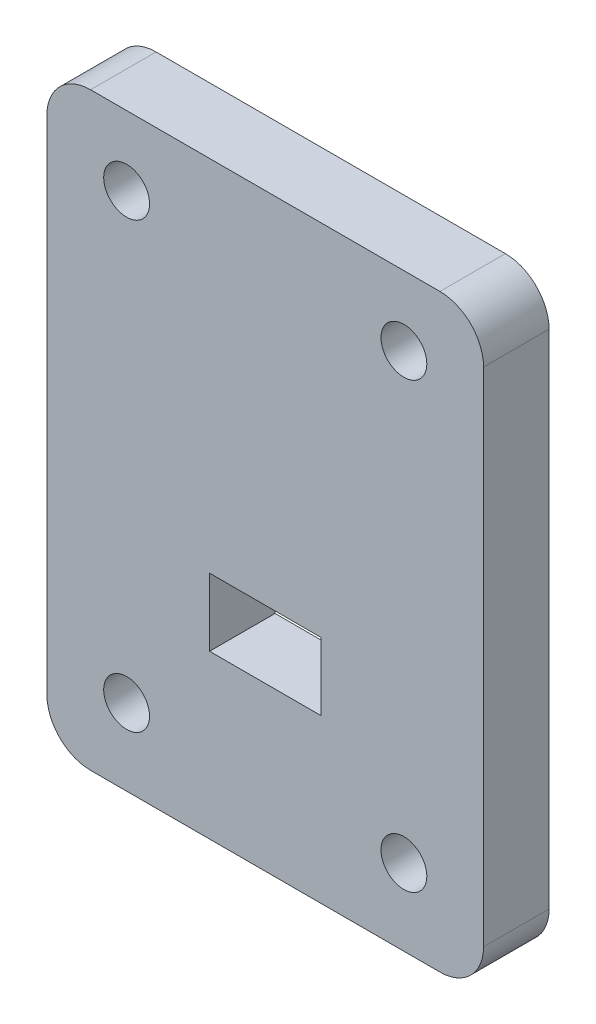
ISO-10303-21;
HEADER;
FILE_DESCRIPTION(('STEP AP214'),'2;1');
FILE_NAME('part.step','',(''),(''),'','','');
FILE_SCHEMA(('AUTOMOTIVE_DESIGN { 1 0 10303 214 1 1 1 1 }'));
ENDSEC;
DATA;
#1=APPLICATION_CONTEXT('core data for automotive mechanical design processes');
#2=APPLICATION_PROTOCOL_DEFINITION('international standard','automotive_design',2000,#1);
#3=PRODUCT_CONTEXT('',#1,'mechanical');
#4=PRODUCT('Part','Part','',(#3));
#5=PRODUCT_RELATED_PRODUCT_CATEGORY('part','',(#4));
#6=PRODUCT_DEFINITION_FORMATION('','',#4);
#7=PRODUCT_DEFINITION_CONTEXT('part definition',#1,'design');
#8=PRODUCT_DEFINITION('design','',#6,#7);
#9=PRODUCT_DEFINITION_SHAPE('','',#8);
#10=(LENGTH_UNIT() NAMED_UNIT(*) SI_UNIT(.MILLI.,.METRE.));
#11=(NAMED_UNIT(*) PLANE_ANGLE_UNIT() SI_UNIT($,.RADIAN.));
#12=(NAMED_UNIT(*) SI_UNIT($,.STERADIAN.) SOLID_ANGLE_UNIT());
#13=UNCERTAINTY_MEASURE_WITH_UNIT(LENGTH_MEASURE(1.E-05),#10,'distance_accuracy_value','');
#14=(GEOMETRIC_REPRESENTATION_CONTEXT(3) GLOBAL_UNCERTAINTY_ASSIGNED_CONTEXT((#13)) GLOBAL_UNIT_ASSIGNED_CONTEXT((#10,
#11,#12)) REPRESENTATION_CONTEXT('',''));
#15=CARTESIAN_POINT('',(0.,0.,0.));
#16=DIRECTION('',(0.,0.,1.));
#17=DIRECTION('',(1.,0.,0.));
#18=AXIS2_PLACEMENT_3D('',#15,#16,#17);
#19=CARTESIAN_POINT('',(10.,-13.5,3.));
#20=DIRECTION('',(-1.,0.,0.));
#21=DIRECTION('',(0.,0.,1.));
#22=AXIS2_PLACEMENT_3D('',#19,#20,#21);
#23=PLANE('',#22);
#24=DIRECTION('',(0.,1.,0.));
#25=VECTOR('',#24,1.);
#26=CARTESIAN_POINT('',(10.,-13.5,0.));
#27=LINE('',#26,#25);
#28=CARTESIAN_POINT('',(10.,-11.5,0.));
#29=VERTEX_POINT('',#28);
#30=CARTESIAN_POINT('',(10.,11.5,0.));
#31=VERTEX_POINT('',#30);
#32=EDGE_CURVE('E158',#29,#31,#27,.T.);
#33=ORIENTED_EDGE('',*,*,#32,.T.);
#34=DIRECTION('',(0.,0.,-1.));
#35=VECTOR('',#34,1.);
#36=CARTESIAN_POINT('',(10.,11.5,3.));
#37=LINE('',#36,#35);
#38=CARTESIAN_POINT('',(10.,11.5,3.));
#39=VERTEX_POINT('',#38);
#40=EDGE_CURVE('E229',#31,#39,#37,.F.);
#41=ORIENTED_EDGE('',*,*,#40,.T.);
#42=DIRECTION('',(0.,1.,0.));
#43=VECTOR('',#42,1.);
#44=CARTESIAN_POINT('',(10.,-13.5,3.));
#45=LINE('',#44,#43);
#46=CARTESIAN_POINT('',(10.,-11.5,3.));
#47=VERTEX_POINT('',#46);
#48=EDGE_CURVE('E161',#47,#39,#45,.T.);
#49=ORIENTED_EDGE('',*,*,#48,.F.);
#50=DIRECTION('',(0.,0.,-1.));
#51=VECTOR('',#50,1.);
#52=CARTESIAN_POINT('',(10.,-11.5,3.));
#53=LINE('',#52,#51);
#54=EDGE_CURVE('E226',#47,#29,#53,.T.);
#55=ORIENTED_EDGE('',*,*,#54,.T.);
#56=EDGE_LOOP('',(#33,#41,#49,#55));
#57=FACE_BOUND('',#56,.T.);
#58=ADVANCED_FACE('F37',(#57),#23,.F.);
#59=CARTESIAN_POINT('',(-10.,13.5,3.));
#60=DIRECTION('',(0.,-1.,0.));
#61=DIRECTION('',(0.,0.,-1.));
#62=AXIS2_PLACEMENT_3D('',#59,#60,#61);
#63=PLANE('',#62);
#64=DIRECTION('',(-1.,0.,0.));
#65=VECTOR('',#64,1.);
#66=CARTESIAN_POINT('',(-10.,13.5,0.));
#67=LINE('',#66,#65);
#68=CARTESIAN_POINT('',(8.,13.5,0.));
#69=VERTEX_POINT('',#68);
#70=CARTESIAN_POINT('',(-8.,13.5,0.));
#71=VERTEX_POINT('',#70);
#72=EDGE_CURVE('E175',#69,#71,#67,.T.);
#73=ORIENTED_EDGE('',*,*,#72,.T.);
#74=DIRECTION('',(0.,0.,-1.));
#75=VECTOR('',#74,1.);
#76=CARTESIAN_POINT('',(-8.,13.5,3.));
#77=LINE('',#76,#75);
#78=CARTESIAN_POINT('',(-8.,13.5,3.));
#79=VERTEX_POINT('',#78);
#80=EDGE_CURVE('E217',#71,#79,#77,.F.);
#81=ORIENTED_EDGE('',*,*,#80,.T.);
#82=DIRECTION('',(-1.,0.,0.));
#83=VECTOR('',#82,1.);
#84=CARTESIAN_POINT('',(-10.,13.5,3.));
#85=LINE('',#84,#83);
#86=CARTESIAN_POINT('',(8.,13.5,3.));
#87=VERTEX_POINT('',#86);
#88=EDGE_CURVE('E164',#87,#79,#85,.T.);
#89=ORIENTED_EDGE('',*,*,#88,.F.);
#90=DIRECTION('',(0.,0.,-1.));
#91=VECTOR('',#90,1.);
#92=CARTESIAN_POINT('',(8.,13.5,3.));
#93=LINE('',#92,#91);
#94=EDGE_CURVE('E214',#87,#69,#93,.T.);
#95=ORIENTED_EDGE('',*,*,#94,.T.);
#96=EDGE_LOOP('',(#73,#81,#89,#95));
#97=FACE_BOUND('',#96,.T.);
#98=ADVANCED_FACE('F253',(#97),#63,.F.);
#99=CARTESIAN_POINT('',(-10.,-13.5,3.));
#100=DIRECTION('',(1.,0.,0.));
#101=DIRECTION('',(0.,0.,-1.));
#102=AXIS2_PLACEMENT_3D('',#99,#100,#101);
#103=PLANE('',#102);
#104=DIRECTION('',(0.,-1.,0.));
#105=VECTOR('',#104,1.);
#106=CARTESIAN_POINT('',(-10.,-13.5,3.));
#107=LINE('',#106,#105);
#108=CARTESIAN_POINT('',(-10.,11.5,3.));
#109=VERTEX_POINT('',#108);
#110=CARTESIAN_POINT('',(-10.,-11.5,3.));
#111=VERTEX_POINT('',#110);
#112=EDGE_CURVE('E168',#109,#111,#107,.T.);
#113=ORIENTED_EDGE('',*,*,#112,.F.);
#114=DIRECTION('',(0.,0.,-1.));
#115=VECTOR('',#114,1.);
#116=CARTESIAN_POINT('',(-10.,11.5,3.));
#117=LINE('',#116,#115);
#118=CARTESIAN_POINT('',(-10.,11.5,0.));
#119=VERTEX_POINT('',#118);
#120=EDGE_CURVE('E203',#109,#119,#117,.T.);
#121=ORIENTED_EDGE('',*,*,#120,.T.);
#122=DIRECTION('',(0.,-1.,0.));
#123=VECTOR('',#122,1.);
#124=CARTESIAN_POINT('',(-10.,-13.5,0.));
#125=LINE('',#124,#123);
#126=CARTESIAN_POINT('',(-10.,-11.5,0.));
#127=VERTEX_POINT('',#126);
#128=EDGE_CURVE('E178',#119,#127,#125,.T.);
#129=ORIENTED_EDGE('',*,*,#128,.T.);
#130=DIRECTION('',(0.,0.,-1.));
#131=VECTOR('',#130,1.);
#132=CARTESIAN_POINT('',(-10.,-11.5,3.));
#133=LINE('',#132,#131);
#134=EDGE_CURVE('E188',#127,#111,#133,.F.);
#135=ORIENTED_EDGE('',*,*,#134,.T.);
#136=EDGE_LOOP('',(#113,#121,#129,#135));
#137=FACE_BOUND('',#136,.T.);
#138=ADVANCED_FACE('F261',(#137),#103,.F.);
#139=CARTESIAN_POINT('',(-10.,-13.5,3.));
#140=DIRECTION('',(0.,1.,0.));
#141=DIRECTION('',(0.,0.,1.));
#142=AXIS2_PLACEMENT_3D('',#139,#140,#141);
#143=PLANE('',#142);
#144=DIRECTION('',(1.,0.,0.));
#145=VECTOR('',#144,1.);
#146=CARTESIAN_POINT('',(-10.,-13.5,0.));
#147=LINE('',#146,#145);
#148=CARTESIAN_POINT('',(-8.,-13.5,0.));
#149=VERTEX_POINT('',#148);
#150=CARTESIAN_POINT('',(8.,-13.5,0.));
#151=VERTEX_POINT('',#150);
#152=EDGE_CURVE('E165',#149,#151,#147,.T.);
#153=ORIENTED_EDGE('',*,*,#152,.T.);
#154=DIRECTION('',(0.,0.,-1.));
#155=VECTOR('',#154,1.);
#156=CARTESIAN_POINT('',(8.,-13.5,3.));
#157=LINE('',#156,#155);
#158=CARTESIAN_POINT('',(8.,-13.5,3.));
#159=VERTEX_POINT('',#158);
#160=EDGE_CURVE('E11',#151,#159,#157,.F.);
#161=ORIENTED_EDGE('',*,*,#160,.T.);
#162=DIRECTION('',(1.,0.,0.));
#163=VECTOR('',#162,1.);
#164=CARTESIAN_POINT('',(-10.,-13.5,3.));
#165=LINE('',#164,#163);
#166=CARTESIAN_POINT('',(-8.,-13.5,3.));
#167=VERTEX_POINT('',#166);
#168=EDGE_CURVE('E170',#167,#159,#165,.T.);
#169=ORIENTED_EDGE('',*,*,#168,.F.);
#170=DIRECTION('',(0.,0.,-1.));
#171=VECTOR('',#170,1.);
#172=CARTESIAN_POINT('',(-8.,-13.5,3.));
#173=LINE('',#172,#171);
#174=EDGE_CURVE('E45',#167,#149,#173,.T.);
#175=ORIENTED_EDGE('',*,*,#174,.T.);
#176=EDGE_LOOP('',(#153,#161,#169,#175));
#177=FACE_BOUND('',#176,.T.);
#178=ADVANCED_FACE('F233',(#177),#143,.F.);
#179=CARTESIAN_POINT('',(0.,0.,3.));
#180=DIRECTION('',(0.,0.,-1.));
#181=DIRECTION('',(-1.,0.,0.));
#182=AXIS2_PLACEMENT_3D('',#179,#180,#181);
#183=PLANE('',#182);
#184=CARTESIAN_POINT('',(-6.35,-10.,3.));
#185=DIRECTION('',(0.,0.,1.));
#186=DIRECTION('',(1.,0.,0.));
#187=AXIS2_PLACEMENT_3D('',#184,#185,#186);
#188=CIRCLE('',#187,1.05);
#189=CARTESIAN_POINT('',(-5.3,-10.,3.));
#190=VERTEX_POINT('',#189);
#191=EDGE_CURVE('E458',#190,#190,#188,.T.);
#192=ORIENTED_EDGE('',*,*,#191,.F.);
#193=EDGE_LOOP('',(#192));
#194=FACE_BOUND('',#193,.T.);
#195=CARTESIAN_POINT('',(6.35,-9.99999999999999,3.));
#196=DIRECTION('',(0.,0.,1.));
#197=DIRECTION('',(1.,0.,0.));
#198=AXIS2_PLACEMENT_3D('',#195,#196,#197);
#199=CIRCLE('',#198,1.05);
#200=CARTESIAN_POINT('',(7.4,-9.99999999999999,3.));
#201=VERTEX_POINT('',#200);
#202=EDGE_CURVE('E462',#201,#201,#199,.T.);
#203=ORIENTED_EDGE('',*,*,#202,.F.);
#204=EDGE_LOOP('',(#203));
#205=FACE_BOUND('',#204,.T.);
#206=CARTESIAN_POINT('',(6.35,10.32,3.));
#207=DIRECTION('',(0.,0.,1.));
#208=DIRECTION('',(1.,0.,0.));
#209=AXIS2_PLACEMENT_3D('',#206,#207,#208);
#210=CIRCLE('',#209,1.05);
#211=CARTESIAN_POINT('',(7.4,10.32,3.));
#212=VERTEX_POINT('',#211);
#213=EDGE_CURVE('E466',#212,#212,#210,.T.);
#214=ORIENTED_EDGE('',*,*,#213,.F.);
#215=EDGE_LOOP('',(#214));
#216=FACE_BOUND('',#215,.T.);
#217=CARTESIAN_POINT('',(-6.35,10.32,3.));
#218=DIRECTION('',(0.,0.,1.));
#219=DIRECTION('',(1.,0.,0.));
#220=AXIS2_PLACEMENT_3D('',#217,#218,#219);
#221=CIRCLE('',#220,1.05);
#222=CARTESIAN_POINT('',(-5.3,10.32,3.));
#223=VERTEX_POINT('',#222);
#224=EDGE_CURVE('E193',#223,#223,#221,.T.);
#225=ORIENTED_EDGE('',*,*,#224,.F.);
#226=EDGE_LOOP('',(#225));
#227=FACE_BOUND('',#226,.T.);
#228=DIRECTION('',(-1.,0.,0.));
#229=VECTOR('',#228,1.);
#230=CARTESIAN_POINT('',(-2.55,-2.95,3.));
#231=LINE('',#230,#229);
#232=CARTESIAN_POINT('',(2.55,-2.95,3.));
#233=VERTEX_POINT('',#232);
#234=CARTESIAN_POINT('',(-2.55,-2.95,3.));
#235=VERTEX_POINT('',#234);
#236=EDGE_CURVE('E142',#233,#235,#231,.T.);
#237=ORIENTED_EDGE('',*,*,#236,.F.);
#238=DIRECTION('',(0.,1.,0.));
#239=VECTOR('',#238,1.);
#240=CARTESIAN_POINT('',(2.55,-6.05,3.));
#241=LINE('',#240,#239);
#242=CARTESIAN_POINT('',(2.55,-6.05,3.));
#243=VERTEX_POINT('',#242);
#244=EDGE_CURVE('E147',#243,#233,#241,.T.);
#245=ORIENTED_EDGE('',*,*,#244,.F.);
#246=DIRECTION('',(1.,0.,0.));
#247=VECTOR('',#246,1.);
#248=CARTESIAN_POINT('',(-2.55,-6.05,3.));
#249=LINE('',#248,#247);
#250=CARTESIAN_POINT('',(-2.55,-6.05,3.));
#251=VERTEX_POINT('',#250);
#252=EDGE_CURVE('E151',#251,#243,#249,.T.);
#253=ORIENTED_EDGE('',*,*,#252,.F.);
#254=DIRECTION('',(0.,-1.,0.));
#255=VECTOR('',#254,1.);
#256=CARTESIAN_POINT('',(-2.55,-6.05,3.));
#257=LINE('',#256,#255);
#258=EDGE_CURVE('E131',#235,#251,#257,.T.);
#259=ORIENTED_EDGE('',*,*,#258,.F.);
#260=EDGE_LOOP('',(#237,#245,#253,#259));
#261=FACE_BOUND('',#260,.T.);
#262=ORIENTED_EDGE('',*,*,#88,.T.);
#263=CARTESIAN_POINT('',(-8.,11.5,3.));
#264=DIRECTION('',(0.,0.,-1.));
#265=DIRECTION('',(-1.,0.,0.));
#266=AXIS2_PLACEMENT_3D('',#263,#264,#265);
#267=CIRCLE('',#266,2.);
#268=EDGE_CURVE('E224',#79,#109,#267,.F.);
#269=ORIENTED_EDGE('',*,*,#268,.T.);
#270=ORIENTED_EDGE('',*,*,#112,.T.);
#271=CARTESIAN_POINT('',(-8.,-11.5,3.));
#272=DIRECTION('',(0.,0.,-1.));
#273=DIRECTION('',(-1.,0.,0.));
#274=AXIS2_PLACEMENT_3D('',#271,#272,#273);
#275=CIRCLE('',#274,2.);
#276=EDGE_CURVE('E57',#111,#167,#275,.F.);
#277=ORIENTED_EDGE('',*,*,#276,.T.);
#278=ORIENTED_EDGE('',*,*,#168,.T.);
#279=CARTESIAN_POINT('',(8.,-11.5,3.));
#280=DIRECTION('',(0.,0.,-1.));
#281=DIRECTION('',(-1.,0.,0.));
#282=AXIS2_PLACEMENT_3D('',#279,#280,#281);
#283=CIRCLE('',#282,2.);
#284=EDGE_CURVE('E220',#159,#47,#283,.F.);
#285=ORIENTED_EDGE('',*,*,#284,.T.);
#286=ORIENTED_EDGE('',*,*,#48,.T.);
#287=CARTESIAN_POINT('',(8.,11.5,3.));
#288=DIRECTION('',(0.,0.,-1.));
#289=DIRECTION('',(-1.,0.,0.));
#290=AXIS2_PLACEMENT_3D('',#287,#288,#289);
#291=CIRCLE('',#290,2.);
#292=EDGE_CURVE('E222',#39,#87,#291,.F.);
#293=ORIENTED_EDGE('',*,*,#292,.T.);
#294=EDGE_LOOP('',(#262,#269,#270,#277,#278,#285,#286,#293));
#295=FACE_BOUND('',#294,.T.);
#296=ADVANCED_FACE('F149',(#194,#205,#216,#227,#261,#295),#183,.F.);
#297=CARTESIAN_POINT('',(0.,0.,0.));
#298=DIRECTION('',(0.,0.,-1.));
#299=DIRECTION('',(-1.,0.,0.));
#300=AXIS2_PLACEMENT_3D('',#297,#298,#299);
#301=PLANE('',#300);
#302=CARTESIAN_POINT('',(-6.35,-10.,0.));
#303=DIRECTION('',(0.,0.,-1.));
#304=DIRECTION('',(-1.,0.,0.));
#305=AXIS2_PLACEMENT_3D('',#302,#303,#304);
#306=CIRCLE('',#305,1.05);
#307=CARTESIAN_POINT('',(-7.4,-10.,0.));
#308=VERTEX_POINT('',#307);
#309=EDGE_CURVE('E199',#308,#308,#306,.T.);
#310=ORIENTED_EDGE('',*,*,#309,.F.);
#311=EDGE_LOOP('',(#310));
#312=FACE_BOUND('',#311,.T.);
#313=CARTESIAN_POINT('',(6.35,-9.99999999999999,0.));
#314=DIRECTION('',(0.,0.,-1.));
#315=DIRECTION('',(-1.,0.,0.));
#316=AXIS2_PLACEMENT_3D('',#313,#314,#315);
#317=CIRCLE('',#316,1.05);
#318=CARTESIAN_POINT('',(5.3,-9.99999999999999,0.));
#319=VERTEX_POINT('',#318);
#320=EDGE_CURVE('E196',#319,#319,#317,.T.);
#321=ORIENTED_EDGE('',*,*,#320,.F.);
#322=EDGE_LOOP('',(#321));
#323=FACE_BOUND('',#322,.T.);
#324=CARTESIAN_POINT('',(6.35,10.32,0.));
#325=DIRECTION('',(0.,0.,-1.));
#326=DIRECTION('',(-1.,0.,0.));
#327=AXIS2_PLACEMENT_3D('',#324,#325,#326);
#328=CIRCLE('',#327,1.05);
#329=CARTESIAN_POINT('',(5.3,10.32,0.));
#330=VERTEX_POINT('',#329);
#331=EDGE_CURVE('E192',#330,#330,#328,.T.);
#332=ORIENTED_EDGE('',*,*,#331,.F.);
#333=EDGE_LOOP('',(#332));
#334=FACE_BOUND('',#333,.T.);
#335=CARTESIAN_POINT('',(-6.35,10.32,0.));
#336=DIRECTION('',(0.,0.,-1.));
#337=DIRECTION('',(-1.,0.,0.));
#338=AXIS2_PLACEMENT_3D('',#335,#336,#337);
#339=CIRCLE('',#338,1.05);
#340=CARTESIAN_POINT('',(-7.4,10.32,0.));
#341=VERTEX_POINT('',#340);
#342=EDGE_CURVE('E189',#341,#341,#339,.T.);
#343=ORIENTED_EDGE('',*,*,#342,.F.);
#344=EDGE_LOOP('',(#343));
#345=FACE_BOUND('',#344,.T.);
#346=DIRECTION('',(0.,-1.,0.));
#347=VECTOR('',#346,1.);
#348=CARTESIAN_POINT('',(2.55,0.,0.));
#349=LINE('',#348,#347);
#350=CARTESIAN_POINT('',(2.55,-2.95,0.));
#351=VERTEX_POINT('',#350);
#352=CARTESIAN_POINT('',(2.55,-6.05,0.));
#353=VERTEX_POINT('',#352);
#354=EDGE_CURVE('E186',#351,#353,#349,.T.);
#355=ORIENTED_EDGE('',*,*,#354,.F.);
#356=DIRECTION('',(1.,0.,0.));
#357=VECTOR('',#356,1.);
#358=CARTESIAN_POINT('',(0.,-2.95,0.));
#359=LINE('',#358,#357);
#360=CARTESIAN_POINT('',(-2.55,-2.95,0.));
#361=VERTEX_POINT('',#360);
#362=EDGE_CURVE('E172',#361,#351,#359,.T.);
#363=ORIENTED_EDGE('',*,*,#362,.F.);
#364=DIRECTION('',(0.,1.,0.));
#365=VECTOR('',#364,1.);
#366=CARTESIAN_POINT('',(-2.55,0.,0.));
#367=LINE('',#366,#365);
#368=CARTESIAN_POINT('',(-2.55,-6.05,0.));
#369=VERTEX_POINT('',#368);
#370=EDGE_CURVE('E134',#369,#361,#367,.T.);
#371=ORIENTED_EDGE('',*,*,#370,.F.);
#372=DIRECTION('',(-1.,0.,0.));
#373=VECTOR('',#372,1.);
#374=CARTESIAN_POINT('',(0.,-6.05,0.));
#375=LINE('',#374,#373);
#376=EDGE_CURVE('E184',#353,#369,#375,.T.);
#377=ORIENTED_EDGE('',*,*,#376,.F.);
#378=EDGE_LOOP('',(#355,#363,#371,#377));
#379=FACE_BOUND('',#378,.T.);
#380=ORIENTED_EDGE('',*,*,#128,.F.);
#381=CARTESIAN_POINT('',(-8.,11.5,0.));
#382=DIRECTION('',(0.,0.,-1.));
#383=DIRECTION('',(-1.,0.,0.));
#384=AXIS2_PLACEMENT_3D('',#381,#382,#383);
#385=CIRCLE('',#384,2.);
#386=EDGE_CURVE('E212',#119,#71,#385,.T.);
#387=ORIENTED_EDGE('',*,*,#386,.T.);
#388=ORIENTED_EDGE('',*,*,#72,.F.);
#389=CARTESIAN_POINT('',(8.,11.5,0.));
#390=DIRECTION('',(0.,0.,-1.));
#391=DIRECTION('',(-1.,0.,0.));
#392=AXIS2_PLACEMENT_3D('',#389,#390,#391);
#393=CIRCLE('',#392,2.);
#394=EDGE_CURVE('E210',#69,#31,#393,.T.);
#395=ORIENTED_EDGE('',*,*,#394,.T.);
#396=ORIENTED_EDGE('',*,*,#32,.F.);
#397=CARTESIAN_POINT('',(8.,-11.5,0.));
#398=DIRECTION('',(0.,0.,-1.));
#399=DIRECTION('',(-1.,0.,0.));
#400=AXIS2_PLACEMENT_3D('',#397,#398,#399);
#401=CIRCLE('',#400,2.);
#402=EDGE_CURVE('E208',#29,#151,#401,.T.);
#403=ORIENTED_EDGE('',*,*,#402,.T.);
#404=ORIENTED_EDGE('',*,*,#152,.F.);
#405=CARTESIAN_POINT('',(-8.,-11.5,0.));
#406=DIRECTION('',(0.,0.,-1.));
#407=DIRECTION('',(-1.,0.,0.));
#408=AXIS2_PLACEMENT_3D('',#405,#406,#407);
#409=CIRCLE('',#408,2.);
#410=EDGE_CURVE('E206',#149,#127,#409,.T.);
#411=ORIENTED_EDGE('',*,*,#410,.T.);
#412=EDGE_LOOP('',(#380,#387,#388,#395,#396,#403,#404,#411));
#413=FACE_BOUND('',#412,.T.);
#414=ADVANCED_FACE('F237',(#312,#323,#334,#345,#379,#413),#301,.T.);
#415=CARTESIAN_POINT('',(2.55,-6.05,-7.));
#416=DIRECTION('',(1.,0.,0.));
#417=DIRECTION('',(0.,0.,-1.));
#418=AXIS2_PLACEMENT_3D('',#415,#416,#417);
#419=PLANE('',#418);
#420=ORIENTED_EDGE('',*,*,#354,.T.);
#421=DIRECTION('',(0.,0.,1.));
#422=VECTOR('',#421,1.);
#423=CARTESIAN_POINT('',(2.55,-6.05,-7.));
#424=LINE('',#423,#422);
#425=EDGE_CURVE('E156',#353,#243,#424,.T.);
#426=ORIENTED_EDGE('',*,*,#425,.T.);
#427=ORIENTED_EDGE('',*,*,#244,.T.);
#428=DIRECTION('',(0.,0.,1.));
#429=VECTOR('',#428,1.);
#430=CARTESIAN_POINT('',(2.55,-2.95,-7.));
#431=LINE('',#430,#429);
#432=EDGE_CURVE('E138',#351,#233,#431,.T.);
#433=ORIENTED_EDGE('',*,*,#432,.F.);
#434=EDGE_LOOP('',(#420,#426,#427,#433));
#435=FACE_BOUND('',#434,.T.);
#436=ADVANCED_FACE('F369',(#435),#419,.F.);
#437=CARTESIAN_POINT('',(-2.55,-6.05,-7.));
#438=DIRECTION('',(0.,-1.,0.));
#439=DIRECTION('',(0.,0.,-1.));
#440=AXIS2_PLACEMENT_3D('',#437,#438,#439);
#441=PLANE('',#440);
#442=ORIENTED_EDGE('',*,*,#376,.T.);
#443=DIRECTION('',(0.,0.,1.));
#444=VECTOR('',#443,1.);
#445=CARTESIAN_POINT('',(-2.55,-6.05,-7.));
#446=LINE('',#445,#444);
#447=EDGE_CURVE('E137',#369,#251,#446,.T.);
#448=ORIENTED_EDGE('',*,*,#447,.T.);
#449=ORIENTED_EDGE('',*,*,#252,.T.);
#450=ORIENTED_EDGE('',*,*,#425,.F.);
#451=EDGE_LOOP('',(#442,#448,#449,#450));
#452=FACE_BOUND('',#451,.T.);
#453=ADVANCED_FACE('F360',(#452),#441,.F.);
#454=CARTESIAN_POINT('',(-2.55,-6.05,-7.));
#455=DIRECTION('',(-1.,0.,0.));
#456=DIRECTION('',(0.,0.,1.));
#457=AXIS2_PLACEMENT_3D('',#454,#455,#456);
#458=PLANE('',#457);
#459=ORIENTED_EDGE('',*,*,#370,.T.);
#460=DIRECTION('',(0.,0.,1.));
#461=VECTOR('',#460,1.);
#462=CARTESIAN_POINT('',(-2.55,-2.95,-7.));
#463=LINE('',#462,#461);
#464=EDGE_CURVE('E126',#361,#235,#463,.T.);
#465=ORIENTED_EDGE('',*,*,#464,.T.);
#466=ORIENTED_EDGE('',*,*,#258,.T.);
#467=ORIENTED_EDGE('',*,*,#447,.F.);
#468=EDGE_LOOP('',(#459,#465,#466,#467));
#469=FACE_BOUND('',#468,.T.);
#470=ADVANCED_FACE('F128',(#469),#458,.F.);
#471=CARTESIAN_POINT('',(-2.55,-2.95,-7.));
#472=DIRECTION('',(0.,1.,0.));
#473=DIRECTION('',(0.,0.,1.));
#474=AXIS2_PLACEMENT_3D('',#471,#472,#473);
#475=PLANE('',#474);
#476=ORIENTED_EDGE('',*,*,#362,.T.);
#477=ORIENTED_EDGE('',*,*,#432,.T.);
#478=ORIENTED_EDGE('',*,*,#236,.T.);
#479=ORIENTED_EDGE('',*,*,#464,.F.);
#480=EDGE_LOOP('',(#476,#477,#478,#479));
#481=FACE_BOUND('',#480,.T.);
#482=ADVANCED_FACE('F143',(#481),#475,.F.);
#483=CARTESIAN_POINT('',(-6.35,10.32,-7.));
#484=DIRECTION('',(0.,0.,1.));
#485=DIRECTION('',(1.,0.,0.));
#486=AXIS2_PLACEMENT_3D('',#483,#484,#485);
#487=CYLINDRICAL_SURFACE('',#486,1.05);
#488=ORIENTED_EDGE('',*,*,#342,.T.);
#489=EDGE_LOOP('',(#488));
#490=FACE_BOUND('',#489,.T.);
#491=ORIENTED_EDGE('',*,*,#224,.T.);
#492=EDGE_LOOP('',(#491));
#493=FACE_BOUND('',#492,.T.);
#494=ADVANCED_FACE('F333',(#490,#493),#487,.F.);
#495=CARTESIAN_POINT('',(6.35,10.32,-7.));
#496=DIRECTION('',(0.,0.,1.));
#497=DIRECTION('',(1.,0.,0.));
#498=AXIS2_PLACEMENT_3D('',#495,#496,#497);
#499=CYLINDRICAL_SURFACE('',#498,1.05);
#500=ORIENTED_EDGE('',*,*,#331,.T.);
#501=EDGE_LOOP('',(#500));
#502=FACE_BOUND('',#501,.T.);
#503=ORIENTED_EDGE('',*,*,#213,.T.);
#504=EDGE_LOOP('',(#503));
#505=FACE_BOUND('',#504,.T.);
#506=ADVANCED_FACE('F323',(#502,#505),#499,.F.);
#507=CARTESIAN_POINT('',(6.35,-9.99999999999999,-7.));
#508=DIRECTION('',(0.,0.,1.));
#509=DIRECTION('',(1.,0.,0.));
#510=AXIS2_PLACEMENT_3D('',#507,#508,#509);
#511=CYLINDRICAL_SURFACE('',#510,1.05);
#512=ORIENTED_EDGE('',*,*,#320,.T.);
#513=EDGE_LOOP('',(#512));
#514=FACE_BOUND('',#513,.T.);
#515=ORIENTED_EDGE('',*,*,#202,.T.);
#516=EDGE_LOOP('',(#515));
#517=FACE_BOUND('',#516,.T.);
#518=ADVANCED_FACE('F313',(#514,#517),#511,.F.);
#519=CARTESIAN_POINT('',(-6.35,-10.,-7.));
#520=DIRECTION('',(0.,0.,1.));
#521=DIRECTION('',(1.,0.,0.));
#522=AXIS2_PLACEMENT_3D('',#519,#520,#521);
#523=CYLINDRICAL_SURFACE('',#522,1.05);
#524=ORIENTED_EDGE('',*,*,#309,.T.);
#525=EDGE_LOOP('',(#524));
#526=FACE_BOUND('',#525,.T.);
#527=ORIENTED_EDGE('',*,*,#191,.T.);
#528=EDGE_LOOP('',(#527));
#529=FACE_BOUND('',#528,.T.);
#530=ADVANCED_FACE('F277',(#526,#529),#523,.F.);
#531=CARTESIAN_POINT('',(-8.,11.5,3.));
#532=DIRECTION('',(0.,0.,-1.));
#533=DIRECTION('',(-1.,0.,0.));
#534=AXIS2_PLACEMENT_3D('',#531,#532,#533);
#535=CYLINDRICAL_SURFACE('',#534,2.);
#536=ORIENTED_EDGE('',*,*,#268,.F.);
#537=ORIENTED_EDGE('',*,*,#80,.F.);
#538=ORIENTED_EDGE('',*,*,#386,.F.);
#539=ORIENTED_EDGE('',*,*,#120,.F.);
#540=EDGE_LOOP('',(#536,#537,#538,#539));
#541=FACE_BOUND('',#540,.T.);
#542=ADVANCED_FACE('F258',(#541),#535,.T.);
#543=CARTESIAN_POINT('',(8.,11.5,3.));
#544=DIRECTION('',(0.,0.,-1.));
#545=DIRECTION('',(-1.,0.,0.));
#546=AXIS2_PLACEMENT_3D('',#543,#544,#545);
#547=CYLINDRICAL_SURFACE('',#546,2.);
#548=ORIENTED_EDGE('',*,*,#292,.F.);
#549=ORIENTED_EDGE('',*,*,#40,.F.);
#550=ORIENTED_EDGE('',*,*,#394,.F.);
#551=ORIENTED_EDGE('',*,*,#94,.F.);
#552=EDGE_LOOP('',(#548,#549,#550,#551));
#553=FACE_BOUND('',#552,.T.);
#554=ADVANCED_FACE('F250',(#553),#547,.T.);
#555=CARTESIAN_POINT('',(8.,-11.5,3.));
#556=DIRECTION('',(0.,0.,-1.));
#557=DIRECTION('',(-1.,0.,0.));
#558=AXIS2_PLACEMENT_3D('',#555,#556,#557);
#559=CYLINDRICAL_SURFACE('',#558,2.);
#560=ORIENTED_EDGE('',*,*,#284,.F.);
#561=ORIENTED_EDGE('',*,*,#160,.F.);
#562=ORIENTED_EDGE('',*,*,#402,.F.);
#563=ORIENTED_EDGE('',*,*,#54,.F.);
#564=EDGE_LOOP('',(#560,#561,#562,#563));
#565=FACE_BOUND('',#564,.T.);
#566=ADVANCED_FACE('F242',(#565),#559,.T.);
#567=CARTESIAN_POINT('',(-8.,-11.5,3.));
#568=DIRECTION('',(0.,0.,-1.));
#569=DIRECTION('',(-1.,0.,0.));
#570=AXIS2_PLACEMENT_3D('',#567,#568,#569);
#571=CYLINDRICAL_SURFACE('',#570,2.);
#572=ORIENTED_EDGE('',*,*,#276,.F.);
#573=ORIENTED_EDGE('',*,*,#134,.F.);
#574=ORIENTED_EDGE('',*,*,#410,.F.);
#575=ORIENTED_EDGE('',*,*,#174,.F.);
#576=EDGE_LOOP('',(#572,#573,#574,#575));
#577=FACE_BOUND('',#576,.T.);
#578=ADVANCED_FACE('F39',(#577),#571,.T.);
#579=CLOSED_SHELL('',(#58,#98,#138,#178,#296,#414,#436,#453,#470,#482,#494,#506,#518,#530,#542,
#554,#566,#578));
#580=MANIFOLD_SOLID_BREP('B2',#579);
#581=ADVANCED_BREP_SHAPE_REPRESENTATION('',(#18,#580),#14);
#582=SHAPE_DEFINITION_REPRESENTATION(#9,#581);
ENDSEC;
END-ISO-10303-21;
